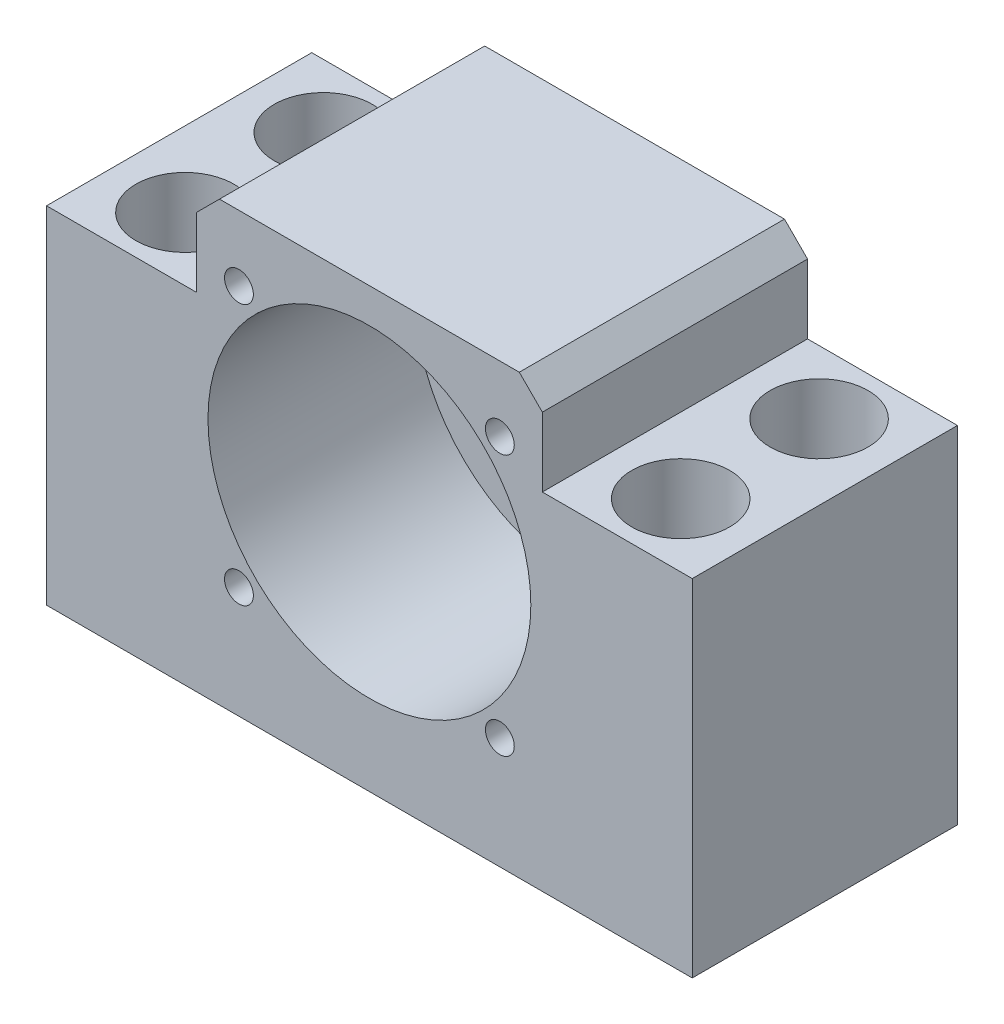
ISO-10303-21;
HEADER;
FILE_DESCRIPTION(('STEP AP214'),'2;1');
FILE_NAME('part.step','',(''),(''),'','','');
FILE_SCHEMA(('AUTOMOTIVE_DESIGN { 1 0 10303 214 1 1 1 1 }'));
ENDSEC;
DATA;
#1=APPLICATION_CONTEXT('core data for automotive mechanical design processes');
#2=APPLICATION_PROTOCOL_DEFINITION('international standard','automotive_design',2000,#1);
#3=PRODUCT_CONTEXT('',#1,'mechanical');
#4=PRODUCT('Part','Part','',(#3));
#5=PRODUCT_RELATED_PRODUCT_CATEGORY('part','',(#4));
#6=PRODUCT_DEFINITION_FORMATION('','',#4);
#7=PRODUCT_DEFINITION_CONTEXT('part definition',#1,'design');
#8=PRODUCT_DEFINITION('design','',#6,#7);
#9=PRODUCT_DEFINITION_SHAPE('','',#8);
#10=(LENGTH_UNIT() NAMED_UNIT(*) SI_UNIT(.MILLI.,.METRE.));
#11=(NAMED_UNIT(*) PLANE_ANGLE_UNIT() SI_UNIT($,.RADIAN.));
#12=(NAMED_UNIT(*) SI_UNIT($,.STERADIAN.) SOLID_ANGLE_UNIT());
#13=UNCERTAINTY_MEASURE_WITH_UNIT(LENGTH_MEASURE(1.E-05),#10,'distance_accuracy_value','');
#14=(GEOMETRIC_REPRESENTATION_CONTEXT(3) GLOBAL_UNCERTAINTY_ASSIGNED_CONTEXT((#13)) GLOBAL_UNIT_ASSIGNED_CONTEXT((#10,
#11,#12)) REPRESENTATION_CONTEXT('',''));
#15=CARTESIAN_POINT('',(0.,0.,0.));
#16=DIRECTION('',(0.,0.,1.));
#17=DIRECTION('',(1.,0.,0.));
#18=AXIS2_PLACEMENT_3D('',#15,#16,#17);
#19=CARTESIAN_POINT('',(-11.31370849898,-11.31370849898,2.00000000000955));
#20=DIRECTION('',(0.,0.,1.));
#21=DIRECTION('',(1.,0.,0.));
#22=AXIS2_PLACEMENT_3D('',#19,#20,#21);
#23=CONICAL_SURFACE('',#22,1.24999999999015,1.02974425866186);
#24=CARTESIAN_POINT('',(-11.3137084989887,-11.31370849898,1.2489242262177));
#25=VERTEX_POINT('',#24);
#26=VERTEX_LOOP('',#25);
#27=FACE_BOUND('',#26,.T.);
#28=CARTESIAN_POINT('',(-11.31370849898,-11.31370849898,2.));
#29=DIRECTION('',(0.,0.,1.));
#30=DIRECTION('',(1.,0.,0.));
#31=AXIS2_PLACEMENT_3D('',#28,#29,#30);
#32=CIRCLE('',#31,1.25);
#33=CARTESIAN_POINT('',(-10.06370849898,-11.31370849898,2.));
#34=VERTEX_POINT('',#33);
#35=EDGE_CURVE('E108',#34,#34,#32,.T.);
#36=ORIENTED_EDGE('',*,*,#35,.T.);
#37=EDGE_LOOP('',(#36));
#38=FACE_BOUND('',#37,.T.);
#39=ADVANCED_FACE('F17',(#27,#38),#23,.F.);
#40=CARTESIAN_POINT('',(11.31370849898,-11.31370849898,2.00000000006639));
#41=DIRECTION('',(0.,0.,1.));
#42=DIRECTION('',(1.,0.,0.));
#43=AXIS2_PLACEMENT_3D('',#40,#41,#42);
#44=CONICAL_SURFACE('',#43,1.25000000006442,1.02974425868194);
#45=CARTESIAN_POINT('',(11.3137084989887,-11.31370849898,1.24892422627454));
#46=VERTEX_POINT('',#45);
#47=VERTEX_LOOP('',#46);
#48=FACE_BOUND('',#47,.T.);
#49=CARTESIAN_POINT('',(11.31370849898,-11.31370849898,2.));
#50=DIRECTION('',(0.,0.,1.));
#51=DIRECTION('',(1.,0.,0.));
#52=AXIS2_PLACEMENT_3D('',#49,#50,#51);
#53=CIRCLE('',#52,1.25);
#54=CARTESIAN_POINT('',(12.56370849898,-11.31370849898,2.));
#55=VERTEX_POINT('',#54);
#56=EDGE_CURVE('E110',#55,#55,#53,.T.);
#57=ORIENTED_EDGE('',*,*,#56,.T.);
#58=EDGE_LOOP('',(#57));
#59=FACE_BOUND('',#58,.T.);
#60=ADVANCED_FACE('F105',(#48,#59),#44,.F.);
#61=CARTESIAN_POINT('',(11.31370849898,11.31370849898,2.00000000006639));
#62=DIRECTION('',(0.,0.,1.));
#63=DIRECTION('',(1.,0.,0.));
#64=AXIS2_PLACEMENT_3D('',#61,#62,#63);
#65=CONICAL_SURFACE('',#64,1.25000000006442,1.02974425868194);
#66=CARTESIAN_POINT('',(11.3137084989887,11.31370849898,1.24892422627454));
#67=VERTEX_POINT('',#66);
#68=VERTEX_LOOP('',#67);
#69=FACE_BOUND('',#68,.T.);
#70=CARTESIAN_POINT('',(11.31370849898,11.31370849898,2.));
#71=DIRECTION('',(0.,0.,1.));
#72=DIRECTION('',(1.,0.,0.));
#73=AXIS2_PLACEMENT_3D('',#70,#71,#72);
#74=CIRCLE('',#73,1.25);
#75=CARTESIAN_POINT('',(12.56370849898,11.31370849898,2.));
#76=VERTEX_POINT('',#75);
#77=EDGE_CURVE('E113',#76,#76,#74,.T.);
#78=ORIENTED_EDGE('',*,*,#77,.T.);
#79=EDGE_LOOP('',(#78));
#80=FACE_BOUND('',#79,.T.);
#81=ADVANCED_FACE('F408',(#69,#80),#65,.F.);
#82=CARTESIAN_POINT('',(-11.31370849898,11.31370849898,2.00000000000955));
#83=DIRECTION('',(0.,0.,1.));
#84=DIRECTION('',(1.,0.,0.));
#85=AXIS2_PLACEMENT_3D('',#82,#83,#84);
#86=CONICAL_SURFACE('',#85,1.24999999999015,1.02974425866186);
#87=CARTESIAN_POINT('',(-11.3137084989887,11.31370849898,1.2489242262177));
#88=VERTEX_POINT('',#87);
#89=VERTEX_LOOP('',#88);
#90=FACE_BOUND('',#89,.T.);
#91=CARTESIAN_POINT('',(-11.31370849898,11.31370849898,2.));
#92=DIRECTION('',(0.,0.,1.));
#93=DIRECTION('',(1.,0.,0.));
#94=AXIS2_PLACEMENT_3D('',#91,#92,#93);
#95=CIRCLE('',#94,1.25);
#96=CARTESIAN_POINT('',(-10.06370849898,11.31370849898,2.));
#97=VERTEX_POINT('',#96);
#98=EDGE_CURVE('E196',#97,#97,#95,.T.);
#99=ORIENTED_EDGE('',*,*,#98,.T.);
#100=EDGE_LOOP('',(#99));
#101=FACE_BOUND('',#100,.T.);
#102=ADVANCED_FACE('F405',(#90,#101),#86,.F.);
#103=CARTESIAN_POINT('',(-21.5,-14.,-6.));
#104=DIRECTION('',(0.,1.,0.));
#105=DIRECTION('',(0.,0.,1.));
#106=AXIS2_PLACEMENT_3D('',#103,#104,#105);
#107=PLANE('',#106);
#108=CARTESIAN_POINT('',(-21.5,-14.,-6.));
#109=DIRECTION('',(0.,1.,0.));
#110=DIRECTION('',(0.,0.,1.));
#111=AXIS2_PLACEMENT_3D('',#108,#109,#110);
#112=CIRCLE('',#111,4.25);
#113=CARTESIAN_POINT('',(-21.5,-14.,-1.75));
#114=VERTEX_POINT('',#113);
#115=EDGE_CURVE('E191',#114,#114,#112,.T.);
#116=ORIENTED_EDGE('',*,*,#115,.T.);
#117=EDGE_LOOP('',(#116));
#118=FACE_BOUND('',#117,.T.);
#119=CARTESIAN_POINT('',(-21.5,-14.,-6.));
#120=DIRECTION('',(0.,1.,0.));
#121=DIRECTION('',(0.,0.,1.));
#122=AXIS2_PLACEMENT_3D('',#119,#120,#121);
#123=CIRCLE('',#122,2.6);
#124=CARTESIAN_POINT('',(-21.5,-14.,-3.4));
#125=VERTEX_POINT('',#124);
#126=EDGE_CURVE('E186',#125,#125,#123,.F.);
#127=ORIENTED_EDGE('',*,*,#126,.T.);
#128=EDGE_LOOP('',(#127));
#129=FACE_BOUND('',#128,.T.);
#130=ADVANCED_FACE('F401',(#118,#129),#107,.T.);
#131=CARTESIAN_POINT('',(-21.5,-14.,6.));
#132=DIRECTION('',(0.,1.,0.));
#133=DIRECTION('',(0.,0.,1.));
#134=AXIS2_PLACEMENT_3D('',#131,#132,#133);
#135=PLANE('',#134);
#136=CARTESIAN_POINT('',(-21.5,-14.,6.));
#137=DIRECTION('',(0.,1.,0.));
#138=DIRECTION('',(0.,0.,1.));
#139=AXIS2_PLACEMENT_3D('',#136,#137,#138);
#140=CIRCLE('',#139,4.25);
#141=CARTESIAN_POINT('',(-21.5,-14.,10.25));
#142=VERTEX_POINT('',#141);
#143=EDGE_CURVE('E189',#142,#142,#140,.T.);
#144=ORIENTED_EDGE('',*,*,#143,.T.);
#145=EDGE_LOOP('',(#144));
#146=FACE_BOUND('',#145,.T.);
#147=CARTESIAN_POINT('',(-21.5,-14.,6.));
#148=DIRECTION('',(0.,1.,0.));
#149=DIRECTION('',(0.,0.,1.));
#150=AXIS2_PLACEMENT_3D('',#147,#148,#149);
#151=CIRCLE('',#150,2.6);
#152=CARTESIAN_POINT('',(-21.5,-14.,8.6));
#153=VERTEX_POINT('',#152);
#154=EDGE_CURVE('E180',#153,#153,#151,.F.);
#155=ORIENTED_EDGE('',*,*,#154,.T.);
#156=EDGE_LOOP('',(#155));
#157=FACE_BOUND('',#156,.T.);
#158=ADVANCED_FACE('F397',(#146,#157),#135,.T.);
#159=CARTESIAN_POINT('',(21.5,-14.,-6.));
#160=DIRECTION('',(0.,1.,0.));
#161=DIRECTION('',(0.,0.,1.));
#162=AXIS2_PLACEMENT_3D('',#159,#160,#161);
#163=PLANE('',#162);
#164=CARTESIAN_POINT('',(21.5,-14.,-6.));
#165=DIRECTION('',(0.,1.,0.));
#166=DIRECTION('',(0.,0.,1.));
#167=AXIS2_PLACEMENT_3D('',#164,#165,#166);
#168=CIRCLE('',#167,4.25);
#169=CARTESIAN_POINT('',(21.5,-14.,-1.75));
#170=VERTEX_POINT('',#169);
#171=EDGE_CURVE('E174',#170,#170,#168,.T.);
#172=ORIENTED_EDGE('',*,*,#171,.T.);
#173=EDGE_LOOP('',(#172));
#174=FACE_BOUND('',#173,.T.);
#175=CARTESIAN_POINT('',(21.5,-14.,-6.));
#176=DIRECTION('',(0.,1.,0.));
#177=DIRECTION('',(0.,0.,1.));
#178=AXIS2_PLACEMENT_3D('',#175,#176,#177);
#179=CIRCLE('',#178,2.6);
#180=CARTESIAN_POINT('',(21.5,-14.,-3.4));
#181=VERTEX_POINT('',#180);
#182=EDGE_CURVE('E183',#181,#181,#179,.F.);
#183=ORIENTED_EDGE('',*,*,#182,.T.);
#184=EDGE_LOOP('',(#183));
#185=FACE_BOUND('',#184,.T.);
#186=ADVANCED_FACE('F390',(#174,#185),#163,.T.);
#187=CARTESIAN_POINT('',(21.5,-14.,6.));
#188=DIRECTION('',(0.,1.,0.));
#189=DIRECTION('',(0.,0.,1.));
#190=AXIS2_PLACEMENT_3D('',#187,#188,#189);
#191=PLANE('',#190);
#192=CARTESIAN_POINT('',(21.5,-14.,6.));
#193=DIRECTION('',(0.,1.,0.));
#194=DIRECTION('',(0.,0.,1.));
#195=AXIS2_PLACEMENT_3D('',#192,#193,#194);
#196=CIRCLE('',#195,4.25);
#197=CARTESIAN_POINT('',(21.5,-14.,10.25));
#198=VERTEX_POINT('',#197);
#199=EDGE_CURVE('E171',#198,#198,#196,.T.);
#200=ORIENTED_EDGE('',*,*,#199,.T.);
#201=EDGE_LOOP('',(#200));
#202=FACE_BOUND('',#201,.T.);
#203=CARTESIAN_POINT('',(21.5,-14.,6.));
#204=DIRECTION('',(0.,1.,0.));
#205=DIRECTION('',(0.,0.,1.));
#206=AXIS2_PLACEMENT_3D('',#203,#204,#205);
#207=CIRCLE('',#206,2.6);
#208=CARTESIAN_POINT('',(21.5,-14.,8.6));
#209=VERTEX_POINT('',#208);
#210=EDGE_CURVE('E177',#209,#209,#207,.F.);
#211=ORIENTED_EDGE('',*,*,#210,.T.);
#212=EDGE_LOOP('',(#211));
#213=FACE_BOUND('',#212,.T.);
#214=ADVANCED_FACE('F381',(#202,#213),#191,.T.);
#215=CARTESIAN_POINT('',(0.,0.,-6.5));
#216=DIRECTION('',(0.,0.,1.));
#217=DIRECTION('',(1.,0.,0.));
#218=AXIS2_PLACEMENT_3D('',#215,#216,#217);
#219=CYLINDRICAL_SURFACE('',#218,14.);
#220=CARTESIAN_POINT('',(0.,0.,-6.5));
#221=DIRECTION('',(0.,0.,1.));
#222=DIRECTION('',(1.,0.,0.));
#223=AXIS2_PLACEMENT_3D('',#220,#221,#222);
#224=CIRCLE('',#223,14.);
#225=CARTESIAN_POINT('',(14.,0.,-6.5));
#226=VERTEX_POINT('',#225);
#227=EDGE_CURVE('E20',#226,#226,#224,.T.);
#228=ORIENTED_EDGE('',*,*,#227,.F.);
#229=EDGE_LOOP('',(#228));
#230=FACE_BOUND('',#229,.T.);
#231=CARTESIAN_POINT('',(0.,0.,11.5));
#232=DIRECTION('',(0.,0.,1.));
#233=DIRECTION('',(1.,0.,0.));
#234=AXIS2_PLACEMENT_3D('',#231,#232,#233);
#235=CIRCLE('',#234,14.);
#236=CARTESIAN_POINT('',(14.,0.,11.5));
#237=VERTEX_POINT('',#236);
#238=EDGE_CURVE('E168',#237,#237,#235,.F.);
#239=ORIENTED_EDGE('',*,*,#238,.F.);
#240=EDGE_LOOP('',(#239));
#241=FACE_BOUND('',#240,.T.);
#242=ADVANCED_FACE('F378',(#230,#241),#219,.F.);
#243=CARTESIAN_POINT('',(-11.31370849898,-11.31370849898,11.5));
#244=DIRECTION('',(0.,0.,1.));
#245=DIRECTION('',(1.,0.,0.));
#246=AXIS2_PLACEMENT_3D('',#243,#244,#245);
#247=CYLINDRICAL_SURFACE('',#246,1.25);
#248=ORIENTED_EDGE('',*,*,#35,.F.);
#249=EDGE_LOOP('',(#248));
#250=FACE_BOUND('',#249,.T.);
#251=CARTESIAN_POINT('',(-11.31370849898,-11.31370849898,11.5));
#252=DIRECTION('',(0.,0.,1.));
#253=DIRECTION('',(1.,0.,0.));
#254=AXIS2_PLACEMENT_3D('',#251,#252,#253);
#255=CIRCLE('',#254,1.25);
#256=CARTESIAN_POINT('',(-10.06370849898,-11.31370849898,11.5));
#257=VERTEX_POINT('',#256);
#258=EDGE_CURVE('E165',#257,#257,#255,.F.);
#259=ORIENTED_EDGE('',*,*,#258,.F.);
#260=EDGE_LOOP('',(#259));
#261=FACE_BOUND('',#260,.T.);
#262=ADVANCED_FACE('F380',(#250,#261),#247,.F.);
#263=CARTESIAN_POINT('',(11.31370849898,-11.31370849898,11.5));
#264=DIRECTION('',(0.,0.,1.));
#265=DIRECTION('',(1.,0.,0.));
#266=AXIS2_PLACEMENT_3D('',#263,#264,#265);
#267=CYLINDRICAL_SURFACE('',#266,1.25);
#268=ORIENTED_EDGE('',*,*,#56,.F.);
#269=EDGE_LOOP('',(#268));
#270=FACE_BOUND('',#269,.T.);
#271=CARTESIAN_POINT('',(11.31370849898,-11.31370849898,11.5));
#272=DIRECTION('',(0.,0.,1.));
#273=DIRECTION('',(1.,0.,0.));
#274=AXIS2_PLACEMENT_3D('',#271,#272,#273);
#275=CIRCLE('',#274,1.25);
#276=CARTESIAN_POINT('',(12.56370849898,-11.31370849898,11.5));
#277=VERTEX_POINT('',#276);
#278=EDGE_CURVE('E162',#277,#277,#275,.F.);
#279=ORIENTED_EDGE('',*,*,#278,.F.);
#280=EDGE_LOOP('',(#279));
#281=FACE_BOUND('',#280,.T.);
#282=ADVANCED_FACE('F388',(#270,#281),#267,.F.);
#283=CARTESIAN_POINT('',(11.31370849898,11.31370849898,11.5));
#284=DIRECTION('',(0.,0.,1.));
#285=DIRECTION('',(1.,0.,0.));
#286=AXIS2_PLACEMENT_3D('',#283,#284,#285);
#287=CYLINDRICAL_SURFACE('',#286,1.25);
#288=ORIENTED_EDGE('',*,*,#77,.F.);
#289=EDGE_LOOP('',(#288));
#290=FACE_BOUND('',#289,.T.);
#291=CARTESIAN_POINT('',(11.31370849898,11.31370849898,11.5));
#292=DIRECTION('',(0.,0.,1.));
#293=DIRECTION('',(1.,0.,0.));
#294=AXIS2_PLACEMENT_3D('',#291,#292,#293);
#295=CIRCLE('',#294,1.25);
#296=CARTESIAN_POINT('',(12.56370849898,11.31370849898,11.5));
#297=VERTEX_POINT('',#296);
#298=EDGE_CURVE('E159',#297,#297,#295,.F.);
#299=ORIENTED_EDGE('',*,*,#298,.F.);
#300=EDGE_LOOP('',(#299));
#301=FACE_BOUND('',#300,.T.);
#302=ADVANCED_FACE('F420',(#290,#301),#287,.F.);
#303=CARTESIAN_POINT('',(-11.31370849898,11.31370849898,11.5));
#304=DIRECTION('',(0.,0.,1.));
#305=DIRECTION('',(1.,0.,0.));
#306=AXIS2_PLACEMENT_3D('',#303,#304,#305);
#307=CYLINDRICAL_SURFACE('',#306,1.25);
#308=ORIENTED_EDGE('',*,*,#98,.F.);
#309=EDGE_LOOP('',(#308));
#310=FACE_BOUND('',#309,.T.);
#311=CARTESIAN_POINT('',(-11.31370849898,11.31370849898,11.5));
#312=DIRECTION('',(0.,0.,1.));
#313=DIRECTION('',(1.,0.,0.));
#314=AXIS2_PLACEMENT_3D('',#311,#312,#313);
#315=CIRCLE('',#314,1.25);
#316=CARTESIAN_POINT('',(-10.06370849898,11.31370849898,11.5));
#317=VERTEX_POINT('',#316);
#318=EDGE_CURVE('E156',#317,#317,#315,.F.);
#319=ORIENTED_EDGE('',*,*,#318,.F.);
#320=EDGE_LOOP('',(#319));
#321=FACE_BOUND('',#320,.T.);
#322=ADVANCED_FACE('F424',(#310,#321),#307,.F.);
#323=CARTESIAN_POINT('',(0.,0.,-6.5));
#324=DIRECTION('',(0.,0.,1.));
#325=DIRECTION('',(1.,0.,0.));
#326=AXIS2_PLACEMENT_3D('',#323,#324,#325);
#327=PLANE('',#326);
#328=ORIENTED_EDGE('',*,*,#227,.T.);
#329=EDGE_LOOP('',(#328));
#330=FACE_BOUND('',#329,.T.);
#331=CARTESIAN_POINT('',(0.,0.,-6.5));
#332=DIRECTION('',(0.,0.,-1.));
#333=DIRECTION('',(-1.,0.,0.));
#334=AXIS2_PLACEMENT_3D('',#331,#332,#333);
#335=CIRCLE('',#334,11.);
#336=CARTESIAN_POINT('',(-11.,0.,-6.5));
#337=VERTEX_POINT('',#336);
#338=EDGE_CURVE('E152',#337,#337,#335,.T.);
#339=ORIENTED_EDGE('',*,*,#338,.T.);
#340=EDGE_LOOP('',(#339));
#341=FACE_BOUND('',#340,.T.);
#342=ADVANCED_FACE('F430',(#330,#341),#327,.T.);
#343=CARTESIAN_POINT('',(-21.5,-14.,-6.));
#344=DIRECTION('',(0.,1.,0.));
#345=DIRECTION('',(0.,0.,1.));
#346=AXIS2_PLACEMENT_3D('',#343,#344,#345);
#347=CYLINDRICAL_SURFACE('',#346,4.25);
#348=ORIENTED_EDGE('',*,*,#115,.F.);
#349=EDGE_LOOP('',(#348));
#350=FACE_BOUND('',#349,.T.);
#351=CARTESIAN_POINT('',(-21.5,9.,-6.));
#352=DIRECTION('',(0.,1.,0.));
#353=DIRECTION('',(0.,0.,1.));
#354=AXIS2_PLACEMENT_3D('',#351,#352,#353);
#355=CIRCLE('',#354,4.25);
#356=CARTESIAN_POINT('',(-21.5,9.,-1.75));
#357=VERTEX_POINT('',#356);
#358=EDGE_CURVE('E148',#357,#357,#355,.T.);
#359=ORIENTED_EDGE('',*,*,#358,.T.);
#360=EDGE_LOOP('',(#359));
#361=FACE_BOUND('',#360,.T.);
#362=ADVANCED_FACE('F434',(#350,#361),#347,.F.);
#363=CARTESIAN_POINT('',(-21.5,-14.,6.));
#364=DIRECTION('',(0.,1.,0.));
#365=DIRECTION('',(0.,0.,1.));
#366=AXIS2_PLACEMENT_3D('',#363,#364,#365);
#367=CYLINDRICAL_SURFACE('',#366,4.25);
#368=ORIENTED_EDGE('',*,*,#143,.F.);
#369=EDGE_LOOP('',(#368));
#370=FACE_BOUND('',#369,.T.);
#371=CARTESIAN_POINT('',(-21.5,9.,6.));
#372=DIRECTION('',(0.,1.,0.));
#373=DIRECTION('',(0.,0.,1.));
#374=AXIS2_PLACEMENT_3D('',#371,#372,#373);
#375=CIRCLE('',#374,4.25);
#376=CARTESIAN_POINT('',(-21.5,9.,10.25));
#377=VERTEX_POINT('',#376);
#378=EDGE_CURVE('E144',#377,#377,#375,.T.);
#379=ORIENTED_EDGE('',*,*,#378,.T.);
#380=EDGE_LOOP('',(#379));
#381=FACE_BOUND('',#380,.T.);
#382=ADVANCED_FACE('F437',(#370,#381),#367,.F.);
#383=CARTESIAN_POINT('',(-21.5,-21.,-6.));
#384=DIRECTION('',(0.,1.,0.));
#385=DIRECTION('',(0.,0.,1.));
#386=AXIS2_PLACEMENT_3D('',#383,#384,#385);
#387=CYLINDRICAL_SURFACE('',#386,2.6);
#388=ORIENTED_EDGE('',*,*,#126,.F.);
#389=EDGE_LOOP('',(#388));
#390=FACE_BOUND('',#389,.T.);
#391=CARTESIAN_POINT('',(-21.5,-21.,-6.));
#392=DIRECTION('',(0.,1.,0.));
#393=DIRECTION('',(0.,0.,1.));
#394=AXIS2_PLACEMENT_3D('',#391,#392,#393);
#395=CIRCLE('',#394,2.6);
#396=CARTESIAN_POINT('',(-21.5,-21.,-3.4));
#397=VERTEX_POINT('',#396);
#398=EDGE_CURVE('E140',#397,#397,#395,.F.);
#399=ORIENTED_EDGE('',*,*,#398,.T.);
#400=EDGE_LOOP('',(#399));
#401=FACE_BOUND('',#400,.T.);
#402=ADVANCED_FACE('F441',(#390,#401),#387,.F.);
#403=CARTESIAN_POINT('',(21.5,-21.,-6.));
#404=DIRECTION('',(0.,1.,0.));
#405=DIRECTION('',(0.,0.,1.));
#406=AXIS2_PLACEMENT_3D('',#403,#404,#405);
#407=CYLINDRICAL_SURFACE('',#406,2.6);
#408=ORIENTED_EDGE('',*,*,#182,.F.);
#409=EDGE_LOOP('',(#408));
#410=FACE_BOUND('',#409,.T.);
#411=CARTESIAN_POINT('',(21.5,-21.,-6.));
#412=DIRECTION('',(0.,1.,0.));
#413=DIRECTION('',(0.,0.,1.));
#414=AXIS2_PLACEMENT_3D('',#411,#412,#413);
#415=CIRCLE('',#414,2.6);
#416=CARTESIAN_POINT('',(21.5,-21.,-3.4));
#417=VERTEX_POINT('',#416);
#418=EDGE_CURVE('E137',#417,#417,#415,.F.);
#419=ORIENTED_EDGE('',*,*,#418,.T.);
#420=EDGE_LOOP('',(#419));
#421=FACE_BOUND('',#420,.T.);
#422=ADVANCED_FACE('F445',(#410,#421),#407,.F.);
#423=CARTESIAN_POINT('',(-21.5,-21.,6.));
#424=DIRECTION('',(0.,1.,0.));
#425=DIRECTION('',(0.,0.,1.));
#426=AXIS2_PLACEMENT_3D('',#423,#424,#425);
#427=CYLINDRICAL_SURFACE('',#426,2.6);
#428=ORIENTED_EDGE('',*,*,#154,.F.);
#429=EDGE_LOOP('',(#428));
#430=FACE_BOUND('',#429,.T.);
#431=CARTESIAN_POINT('',(-21.5,-21.,6.));
#432=DIRECTION('',(0.,1.,0.));
#433=DIRECTION('',(0.,0.,1.));
#434=AXIS2_PLACEMENT_3D('',#431,#432,#433);
#435=CIRCLE('',#434,2.6);
#436=CARTESIAN_POINT('',(-21.5,-21.,8.6));
#437=VERTEX_POINT('',#436);
#438=EDGE_CURVE('E134',#437,#437,#435,.F.);
#439=ORIENTED_EDGE('',*,*,#438,.T.);
#440=EDGE_LOOP('',(#439));
#441=FACE_BOUND('',#440,.T.);
#442=ADVANCED_FACE('F332',(#430,#441),#427,.F.);
#443=CARTESIAN_POINT('',(21.5,-21.,6.));
#444=DIRECTION('',(0.,1.,0.));
#445=DIRECTION('',(0.,0.,1.));
#446=AXIS2_PLACEMENT_3D('',#443,#444,#445);
#447=CYLINDRICAL_SURFACE('',#446,2.6);
#448=ORIENTED_EDGE('',*,*,#210,.F.);
#449=EDGE_LOOP('',(#448));
#450=FACE_BOUND('',#449,.T.);
#451=CARTESIAN_POINT('',(21.5,-21.,6.));
#452=DIRECTION('',(0.,1.,0.));
#453=DIRECTION('',(0.,0.,1.));
#454=AXIS2_PLACEMENT_3D('',#451,#452,#453);
#455=CIRCLE('',#454,2.6);
#456=CARTESIAN_POINT('',(21.5,-21.,8.6));
#457=VERTEX_POINT('',#456);
#458=EDGE_CURVE('E130',#457,#457,#455,.F.);
#459=ORIENTED_EDGE('',*,*,#458,.T.);
#460=EDGE_LOOP('',(#459));
#461=FACE_BOUND('',#460,.T.);
#462=ADVANCED_FACE('F321',(#450,#461),#447,.F.);
#463=CARTESIAN_POINT('',(21.5,-14.,-6.));
#464=DIRECTION('',(0.,1.,0.));
#465=DIRECTION('',(0.,0.,1.));
#466=AXIS2_PLACEMENT_3D('',#463,#464,#465);
#467=CYLINDRICAL_SURFACE('',#466,4.25);
#468=ORIENTED_EDGE('',*,*,#171,.F.);
#469=EDGE_LOOP('',(#468));
#470=FACE_BOUND('',#469,.T.);
#471=CARTESIAN_POINT('',(21.5,9.,-6.));
#472=DIRECTION('',(0.,1.,0.));
#473=DIRECTION('',(0.,0.,1.));
#474=AXIS2_PLACEMENT_3D('',#471,#472,#473);
#475=CIRCLE('',#474,4.25);
#476=CARTESIAN_POINT('',(21.5,9.,-1.75));
#477=VERTEX_POINT('',#476);
#478=EDGE_CURVE('E126',#477,#477,#475,.T.);
#479=ORIENTED_EDGE('',*,*,#478,.T.);
#480=EDGE_LOOP('',(#479));
#481=FACE_BOUND('',#480,.T.);
#482=ADVANCED_FACE('F318',(#470,#481),#467,.F.);
#483=CARTESIAN_POINT('',(21.5,-14.,6.));
#484=DIRECTION('',(0.,1.,0.));
#485=DIRECTION('',(0.,0.,1.));
#486=AXIS2_PLACEMENT_3D('',#483,#484,#485);
#487=CYLINDRICAL_SURFACE('',#486,4.25);
#488=ORIENTED_EDGE('',*,*,#199,.F.);
#489=EDGE_LOOP('',(#488));
#490=FACE_BOUND('',#489,.T.);
#491=CARTESIAN_POINT('',(21.5,9.,6.));
#492=DIRECTION('',(0.,1.,0.));
#493=DIRECTION('',(0.,0.,1.));
#494=AXIS2_PLACEMENT_3D('',#491,#492,#493);
#495=CIRCLE('',#494,4.25);
#496=CARTESIAN_POINT('',(21.5,9.,10.25));
#497=VERTEX_POINT('',#496);
#498=EDGE_CURVE('E122',#497,#497,#495,.T.);
#499=ORIENTED_EDGE('',*,*,#498,.T.);
#500=EDGE_LOOP('',(#499));
#501=FACE_BOUND('',#500,.T.);
#502=ADVANCED_FACE('F320',(#490,#501),#487,.F.);
#503=CARTESIAN_POINT('',(-2.25514051877E-13,30.,11.5));
#504=DIRECTION('',(0.,0.,1.));
#505=DIRECTION('',(1.,0.,0.));
#506=AXIS2_PLACEMENT_3D('',#503,#504,#505);
#507=PLANE('',#506);
#508=DIRECTION('',(0.,1.,0.));
#509=VECTOR('',#508,1.);
#510=CARTESIAN_POINT('',(28.,-21.,11.5));
#511=LINE('',#510,#509);
#512=CARTESIAN_POINT('',(28.,-21.,11.5));
#513=VERTEX_POINT('',#512);
#514=CARTESIAN_POINT('',(28.,9.,11.5));
#515=VERTEX_POINT('',#514);
#516=EDGE_CURVE('E129',#513,#515,#511,.T.);
#517=ORIENTED_EDGE('',*,*,#516,.T.);
#518=DIRECTION('',(1.,0.,0.));
#519=VECTOR('',#518,1.);
#520=CARTESIAN_POINT('',(28.,9.,11.5));
#521=LINE('',#520,#519);
#522=CARTESIAN_POINT('',(15.,9.,11.5));
#523=VERTEX_POINT('',#522);
#524=EDGE_CURVE('E121',#515,#523,#521,.F.);
#525=ORIENTED_EDGE('',*,*,#524,.T.);
#526=DIRECTION('',(0.,1.,0.));
#527=VECTOR('',#526,1.);
#528=CARTESIAN_POINT('',(15.,9.,11.5));
#529=LINE('',#528,#527);
#530=CARTESIAN_POINT('',(15.,15.,11.5));
#531=VERTEX_POINT('',#530);
#532=EDGE_CURVE('E155',#523,#531,#529,.T.);
#533=ORIENTED_EDGE('',*,*,#532,.T.);
#534=DIRECTION('',(0.707106781186548,-0.707106781186548,0.));
#535=VECTOR('',#534,1.);
#536=CARTESIAN_POINT('',(13.,17.,11.5));
#537=LINE('',#536,#535);
#538=CARTESIAN_POINT('',(13.,17.,11.5));
#539=VERTEX_POINT('',#538);
#540=EDGE_CURVE('E209',#531,#539,#537,.F.);
#541=ORIENTED_EDGE('',*,*,#540,.T.);
#542=DIRECTION('',(1.,0.,0.));
#543=VECTOR('',#542,1.);
#544=CARTESIAN_POINT('',(13.,17.,11.5));
#545=LINE('',#544,#543);
#546=CARTESIAN_POINT('',(-13.,17.,11.5));
#547=VERTEX_POINT('',#546);
#548=EDGE_CURVE('E214',#539,#547,#545,.F.);
#549=ORIENTED_EDGE('',*,*,#548,.T.);
#550=DIRECTION('',(0.707106781186548,0.707106781186548,0.));
#551=VECTOR('',#550,1.);
#552=CARTESIAN_POINT('',(-15.,15.,11.5));
#553=LINE('',#552,#551);
#554=CARTESIAN_POINT('',(-15.,15.,11.5));
#555=VERTEX_POINT('',#554);
#556=EDGE_CURVE('E219',#547,#555,#553,.F.);
#557=ORIENTED_EDGE('',*,*,#556,.T.);
#558=DIRECTION('',(0.,1.,0.));
#559=VECTOR('',#558,1.);
#560=CARTESIAN_POINT('',(-15.,15.,11.5));
#561=LINE('',#560,#559);
#562=CARTESIAN_POINT('',(-15.,9.,11.5));
#563=VERTEX_POINT('',#562);
#564=EDGE_CURVE('E151',#555,#563,#561,.F.);
#565=ORIENTED_EDGE('',*,*,#564,.T.);
#566=DIRECTION('',(1.,0.,0.));
#567=VECTOR('',#566,1.);
#568=CARTESIAN_POINT('',(-28.,9.,11.5));
#569=LINE('',#568,#567);
#570=CARTESIAN_POINT('',(-28.,9.,11.5));
#571=VERTEX_POINT('',#570);
#572=EDGE_CURVE('E227',#563,#571,#569,.F.);
#573=ORIENTED_EDGE('',*,*,#572,.T.);
#574=DIRECTION('',(0.,1.,0.));
#575=VECTOR('',#574,1.);
#576=CARTESIAN_POINT('',(-28.,-21.,11.5));
#577=LINE('',#576,#575);
#578=CARTESIAN_POINT('',(-28.,-21.,11.5));
#579=VERTEX_POINT('',#578);
#580=EDGE_CURVE('E143',#571,#579,#577,.F.);
#581=ORIENTED_EDGE('',*,*,#580,.T.);
#582=DIRECTION('',(1.,0.,0.));
#583=VECTOR('',#582,1.);
#584=CARTESIAN_POINT('',(-28.,-21.,11.5));
#585=LINE('',#584,#583);
#586=EDGE_CURVE('E235',#579,#513,#585,.T.);
#587=ORIENTED_EDGE('',*,*,#586,.T.);
#588=EDGE_LOOP('',(#517,#525,#533,#541,#549,#557,#565,#573,#581,#587));
#589=FACE_BOUND('',#588,.T.);
#590=ORIENTED_EDGE('',*,*,#318,.T.);
#591=EDGE_LOOP('',(#590));
#592=FACE_BOUND('',#591,.T.);
#593=ORIENTED_EDGE('',*,*,#298,.T.);
#594=EDGE_LOOP('',(#593));
#595=FACE_BOUND('',#594,.T.);
#596=ORIENTED_EDGE('',*,*,#278,.T.);
#597=EDGE_LOOP('',(#596));
#598=FACE_BOUND('',#597,.T.);
#599=ORIENTED_EDGE('',*,*,#258,.T.);
#600=EDGE_LOOP('',(#599));
#601=FACE_BOUND('',#600,.T.);
#602=ORIENTED_EDGE('',*,*,#238,.T.);
#603=EDGE_LOOP('',(#602));
#604=FACE_BOUND('',#603,.T.);
#605=ADVANCED_FACE('F329',(#589,#592,#595,#598,#601,#604),#507,.T.);
#606=CARTESIAN_POINT('',(0.,0.,11.5));
#607=DIRECTION('',(0.,0.,-1.));
#608=DIRECTION('',(-1.,0.,0.));
#609=AXIS2_PLACEMENT_3D('',#606,#607,#608);
#610=CYLINDRICAL_SURFACE('',#609,11.);
#611=ORIENTED_EDGE('',*,*,#338,.F.);
#612=EDGE_LOOP('',(#611));
#613=FACE_BOUND('',#612,.T.);
#614=CARTESIAN_POINT('',(0.,0.,-11.5));
#615=DIRECTION('',(0.,0.,-1.));
#616=DIRECTION('',(-1.,0.,0.));
#617=AXIS2_PLACEMENT_3D('',#614,#615,#616);
#618=CIRCLE('',#617,11.);
#619=CARTESIAN_POINT('',(-11.,0.,-11.5));
#620=VERTEX_POINT('',#619);
#621=EDGE_CURVE('E117',#620,#620,#618,.T.);
#622=ORIENTED_EDGE('',*,*,#621,.T.);
#623=EDGE_LOOP('',(#622));
#624=FACE_BOUND('',#623,.T.);
#625=ADVANCED_FACE('F359',(#613,#624),#610,.F.);
#626=CARTESIAN_POINT('',(15.,9.,11.5));
#627=DIRECTION('',(-1.,0.,0.));
#628=DIRECTION('',(0.,0.,1.));
#629=AXIS2_PLACEMENT_3D('',#626,#627,#628);
#630=PLANE('',#629);
#631=DIRECTION('',(0.,0.,-1.));
#632=VECTOR('',#631,1.);
#633=CARTESIAN_POINT('',(15.,9.,11.5));
#634=LINE('',#633,#632);
#635=CARTESIAN_POINT('',(15.,9.,-11.5));
#636=VERTEX_POINT('',#635);
#637=EDGE_CURVE('E125',#523,#636,#634,.T.);
#638=ORIENTED_EDGE('',*,*,#637,.T.);
#639=DIRECTION('',(0.,1.,0.));
#640=VECTOR('',#639,1.);
#641=CARTESIAN_POINT('',(15.,30.,-11.5));
#642=LINE('',#641,#640);
#643=CARTESIAN_POINT('',(15.,15.,-11.5));
#644=VERTEX_POINT('',#643);
#645=EDGE_CURVE('E120',#636,#644,#642,.T.);
#646=ORIENTED_EDGE('',*,*,#645,.T.);
#647=DIRECTION('',(0.,0.,1.));
#648=VECTOR('',#647,1.);
#649=CARTESIAN_POINT('',(15.,15.,11.5));
#650=LINE('',#649,#648);
#651=EDGE_CURVE('E206',#644,#531,#650,.T.);
#652=ORIENTED_EDGE('',*,*,#651,.T.);
#653=ORIENTED_EDGE('',*,*,#532,.F.);
#654=EDGE_LOOP('',(#638,#646,#652,#653));
#655=FACE_BOUND('',#654,.T.);
#656=ADVANCED_FACE('F308',(#655),#630,.F.);
#657=CARTESIAN_POINT('',(13.,17.,11.5));
#658=DIRECTION('',(-0.707106781186548,-0.707106781186548,0.));
#659=DIRECTION('',(0.707106781186548,-0.707106781186548,0.));
#660=AXIS2_PLACEMENT_3D('',#657,#658,#659);
#661=PLANE('',#660);
#662=ORIENTED_EDGE('',*,*,#651,.F.);
#663=DIRECTION('',(-0.707106781186547,0.707106781186548,0.));
#664=VECTOR('',#663,1.);
#665=CARTESIAN_POINT('',(15.,15.,-11.5));
#666=LINE('',#665,#664);
#667=CARTESIAN_POINT('',(13.,17.,-11.5));
#668=VERTEX_POINT('',#667);
#669=EDGE_CURVE('E248',#644,#668,#666,.T.);
#670=ORIENTED_EDGE('',*,*,#669,.T.);
#671=DIRECTION('',(0.,0.,-1.));
#672=VECTOR('',#671,1.);
#673=CARTESIAN_POINT('',(13.,17.,11.5));
#674=LINE('',#673,#672);
#675=EDGE_CURVE('E211',#668,#539,#674,.F.);
#676=ORIENTED_EDGE('',*,*,#675,.T.);
#677=ORIENTED_EDGE('',*,*,#540,.F.);
#678=EDGE_LOOP('',(#662,#670,#676,#677));
#679=FACE_BOUND('',#678,.T.);
#680=ADVANCED_FACE('F305',(#679),#661,.F.);
#681=CARTESIAN_POINT('',(13.,17.,11.5));
#682=DIRECTION('',(0.,-1.,0.));
#683=DIRECTION('',(0.,0.,-1.));
#684=AXIS2_PLACEMENT_3D('',#681,#682,#683);
#685=PLANE('',#684);
#686=ORIENTED_EDGE('',*,*,#675,.F.);
#687=DIRECTION('',(1.,0.,0.));
#688=VECTOR('',#687,1.);
#689=CARTESIAN_POINT('',(-2.25514051877E-13,17.,-11.5));
#690=LINE('',#689,#688);
#691=CARTESIAN_POINT('',(-13.,17.,-11.5));
#692=VERTEX_POINT('',#691);
#693=EDGE_CURVE('E251',#668,#692,#690,.F.);
#694=ORIENTED_EDGE('',*,*,#693,.T.);
#695=DIRECTION('',(0.,0.,1.));
#696=VECTOR('',#695,1.);
#697=CARTESIAN_POINT('',(-13.,17.,11.5));
#698=LINE('',#697,#696);
#699=EDGE_CURVE('E216',#692,#547,#698,.T.);
#700=ORIENTED_EDGE('',*,*,#699,.T.);
#701=ORIENTED_EDGE('',*,*,#548,.F.);
#702=EDGE_LOOP('',(#686,#694,#700,#701));
#703=FACE_BOUND('',#702,.T.);
#704=ADVANCED_FACE('F302',(#703),#685,.F.);
#705=CARTESIAN_POINT('',(-15.,15.,11.5));
#706=DIRECTION('',(0.707106781186548,-0.707106781186548,0.));
#707=DIRECTION('',(0.707106781186548,0.707106781186548,0.));
#708=AXIS2_PLACEMENT_3D('',#705,#706,#707);
#709=PLANE('',#708);
#710=ORIENTED_EDGE('',*,*,#699,.F.);
#711=DIRECTION('',(-0.707106781186547,-0.707106781186548,0.));
#712=VECTOR('',#711,1.);
#713=CARTESIAN_POINT('',(-13.,17.,-11.5));
#714=LINE('',#713,#712);
#715=CARTESIAN_POINT('',(-15.,15.,-11.5));
#716=VERTEX_POINT('',#715);
#717=EDGE_CURVE('E254',#692,#716,#714,.T.);
#718=ORIENTED_EDGE('',*,*,#717,.T.);
#719=DIRECTION('',(0.,0.,-1.));
#720=VECTOR('',#719,1.);
#721=CARTESIAN_POINT('',(-15.,15.,11.5));
#722=LINE('',#721,#720);
#723=EDGE_CURVE('E221',#716,#555,#722,.F.);
#724=ORIENTED_EDGE('',*,*,#723,.T.);
#725=ORIENTED_EDGE('',*,*,#556,.F.);
#726=EDGE_LOOP('',(#710,#718,#724,#725));
#727=FACE_BOUND('',#726,.T.);
#728=ADVANCED_FACE('F298',(#727),#709,.F.);
#729=CARTESIAN_POINT('',(-15.,15.,11.5));
#730=DIRECTION('',(1.,0.,0.));
#731=DIRECTION('',(0.,0.,-1.));
#732=AXIS2_PLACEMENT_3D('',#729,#730,#731);
#733=PLANE('',#732);
#734=ORIENTED_EDGE('',*,*,#723,.F.);
#735=DIRECTION('',(0.,1.,0.));
#736=VECTOR('',#735,1.);
#737=CARTESIAN_POINT('',(-15.,30.,-11.5));
#738=LINE('',#737,#736);
#739=CARTESIAN_POINT('',(-15.,9.,-11.5));
#740=VERTEX_POINT('',#739);
#741=EDGE_CURVE('E257',#716,#740,#738,.F.);
#742=ORIENTED_EDGE('',*,*,#741,.T.);
#743=DIRECTION('',(0.,0.,-1.));
#744=VECTOR('',#743,1.);
#745=CARTESIAN_POINT('',(-15.,9.,11.5));
#746=LINE('',#745,#744);
#747=EDGE_CURVE('E147',#740,#563,#746,.F.);
#748=ORIENTED_EDGE('',*,*,#747,.T.);
#749=ORIENTED_EDGE('',*,*,#564,.F.);
#750=EDGE_LOOP('',(#734,#742,#748,#749));
#751=FACE_BOUND('',#750,.T.);
#752=ADVANCED_FACE('F294',(#751),#733,.F.);
#753=CARTESIAN_POINT('',(-28.,9.,11.5));
#754=DIRECTION('',(0.,-1.,0.));
#755=DIRECTION('',(0.,0.,-1.));
#756=AXIS2_PLACEMENT_3D('',#753,#754,#755);
#757=PLANE('',#756);
#758=ORIENTED_EDGE('',*,*,#747,.F.);
#759=DIRECTION('',(1.,0.,0.));
#760=VECTOR('',#759,1.);
#761=CARTESIAN_POINT('',(-2.25514051877E-13,9.,-11.5));
#762=LINE('',#761,#760);
#763=CARTESIAN_POINT('',(-28.,9.,-11.5));
#764=VERTEX_POINT('',#763);
#765=EDGE_CURVE('E260',#740,#764,#762,.F.);
#766=ORIENTED_EDGE('',*,*,#765,.T.);
#767=DIRECTION('',(0.,0.,-1.));
#768=VECTOR('',#767,1.);
#769=CARTESIAN_POINT('',(-28.,9.00000000000001,11.5));
#770=LINE('',#769,#768);
#771=EDGE_CURVE('E229',#764,#571,#770,.F.);
#772=ORIENTED_EDGE('',*,*,#771,.T.);
#773=ORIENTED_EDGE('',*,*,#572,.F.);
#774=EDGE_LOOP('',(#758,#766,#772,#773));
#775=FACE_BOUND('',#774,.T.);
#776=ORIENTED_EDGE('',*,*,#378,.F.);
#777=EDGE_LOOP('',(#776));
#778=FACE_BOUND('',#777,.T.);
#779=ORIENTED_EDGE('',*,*,#358,.F.);
#780=EDGE_LOOP('',(#779));
#781=FACE_BOUND('',#780,.T.);
#782=ADVANCED_FACE('F289',(#775,#778,#781),#757,.F.);
#783=CARTESIAN_POINT('',(-28.,-21.,11.5));
#784=DIRECTION('',(1.,0.,0.));
#785=DIRECTION('',(0.,0.,-1.));
#786=AXIS2_PLACEMENT_3D('',#783,#784,#785);
#787=PLANE('',#786);
#788=ORIENTED_EDGE('',*,*,#771,.F.);
#789=DIRECTION('',(0.,1.,0.));
#790=VECTOR('',#789,1.);
#791=CARTESIAN_POINT('',(-28.,30.,-11.5));
#792=LINE('',#791,#790);
#793=CARTESIAN_POINT('',(-28.,-21.,-11.5));
#794=VERTEX_POINT('',#793);
#795=EDGE_CURVE('E263',#764,#794,#792,.F.);
#796=ORIENTED_EDGE('',*,*,#795,.T.);
#797=DIRECTION('',(0.,0.,1.));
#798=VECTOR('',#797,1.);
#799=CARTESIAN_POINT('',(-28.,-21.,11.5));
#800=LINE('',#799,#798);
#801=EDGE_CURVE('E133',#794,#579,#800,.T.);
#802=ORIENTED_EDGE('',*,*,#801,.T.);
#803=ORIENTED_EDGE('',*,*,#580,.F.);
#804=EDGE_LOOP('',(#788,#796,#802,#803));
#805=FACE_BOUND('',#804,.T.);
#806=ADVANCED_FACE('F285',(#805),#787,.F.);
#807=CARTESIAN_POINT('',(-28.,-21.,11.5));
#808=DIRECTION('',(0.,1.,0.));
#809=DIRECTION('',(0.,0.,1.));
#810=AXIS2_PLACEMENT_3D('',#807,#808,#809);
#811=PLANE('',#810);
#812=ORIENTED_EDGE('',*,*,#801,.F.);
#813=DIRECTION('',(1.,0.,0.));
#814=VECTOR('',#813,1.);
#815=CARTESIAN_POINT('',(-2.25514051877E-13,-21.,-11.5));
#816=LINE('',#815,#814);
#817=CARTESIAN_POINT('',(28.,-21.,-11.5));
#818=VERTEX_POINT('',#817);
#819=EDGE_CURVE('E266',#794,#818,#816,.T.);
#820=ORIENTED_EDGE('',*,*,#819,.T.);
#821=DIRECTION('',(0.,0.,1.));
#822=VECTOR('',#821,1.);
#823=CARTESIAN_POINT('',(28.,-21.,11.5));
#824=LINE('',#823,#822);
#825=EDGE_CURVE('E237',#818,#513,#824,.T.);
#826=ORIENTED_EDGE('',*,*,#825,.T.);
#827=ORIENTED_EDGE('',*,*,#586,.F.);
#828=EDGE_LOOP('',(#812,#820,#826,#827));
#829=FACE_BOUND('',#828,.T.);
#830=ORIENTED_EDGE('',*,*,#458,.F.);
#831=EDGE_LOOP('',(#830));
#832=FACE_BOUND('',#831,.T.);
#833=ORIENTED_EDGE('',*,*,#438,.F.);
#834=EDGE_LOOP('',(#833));
#835=FACE_BOUND('',#834,.T.);
#836=ORIENTED_EDGE('',*,*,#418,.F.);
#837=EDGE_LOOP('',(#836));
#838=FACE_BOUND('',#837,.T.);
#839=ORIENTED_EDGE('',*,*,#398,.F.);
#840=EDGE_LOOP('',(#839));
#841=FACE_BOUND('',#840,.T.);
#842=ADVANCED_FACE('F280',(#829,#832,#835,#838,#841),#811,.F.);
#843=CARTESIAN_POINT('',(28.,-21.,11.5));
#844=DIRECTION('',(-1.,0.,0.));
#845=DIRECTION('',(0.,0.,1.));
#846=AXIS2_PLACEMENT_3D('',#843,#844,#845);
#847=PLANE('',#846);
#848=ORIENTED_EDGE('',*,*,#825,.F.);
#849=DIRECTION('',(0.,1.,0.));
#850=VECTOR('',#849,1.);
#851=CARTESIAN_POINT('',(28.,30.,-11.5));
#852=LINE('',#851,#850);
#853=CARTESIAN_POINT('',(28.,9.,-11.5));
#854=VERTEX_POINT('',#853);
#855=EDGE_CURVE('E26',#818,#854,#852,.T.);
#856=ORIENTED_EDGE('',*,*,#855,.T.);
#857=DIRECTION('',(0.,0.,-1.));
#858=VECTOR('',#857,1.);
#859=CARTESIAN_POINT('',(28.,9.,11.5));
#860=LINE('',#859,#858);
#861=EDGE_CURVE('E34',#854,#515,#860,.F.);
#862=ORIENTED_EDGE('',*,*,#861,.T.);
#863=ORIENTED_EDGE('',*,*,#516,.F.);
#864=EDGE_LOOP('',(#848,#856,#862,#863));
#865=FACE_BOUND('',#864,.T.);
#866=ADVANCED_FACE('F272',(#865),#847,.F.);
#867=CARTESIAN_POINT('',(28.,9.,11.5));
#868=DIRECTION('',(0.,-1.,0.));
#869=DIRECTION('',(0.,0.,-1.));
#870=AXIS2_PLACEMENT_3D('',#867,#868,#869);
#871=PLANE('',#870);
#872=ORIENTED_EDGE('',*,*,#861,.F.);
#873=DIRECTION('',(1.,0.,0.));
#874=VECTOR('',#873,1.);
#875=CARTESIAN_POINT('',(-2.25514051877E-13,9.,-11.5));
#876=LINE('',#875,#874);
#877=EDGE_CURVE('E11',#854,#636,#876,.F.);
#878=ORIENTED_EDGE('',*,*,#877,.T.);
#879=ORIENTED_EDGE('',*,*,#637,.F.);
#880=ORIENTED_EDGE('',*,*,#524,.F.);
#881=EDGE_LOOP('',(#872,#878,#879,#880));
#882=FACE_BOUND('',#881,.T.);
#883=ORIENTED_EDGE('',*,*,#498,.F.);
#884=EDGE_LOOP('',(#883));
#885=FACE_BOUND('',#884,.T.);
#886=ORIENTED_EDGE('',*,*,#478,.F.);
#887=EDGE_LOOP('',(#886));
#888=FACE_BOUND('',#887,.T.);
#889=ADVANCED_FACE('F310',(#882,#885,#888),#871,.F.);
#890=CARTESIAN_POINT('',(-2.25514051877E-13,30.,-11.5));
#891=DIRECTION('',(0.,0.,1.));
#892=DIRECTION('',(1.,0.,0.));
#893=AXIS2_PLACEMENT_3D('',#890,#891,#892);
#894=PLANE('',#893);
#895=ORIENTED_EDGE('',*,*,#855,.F.);
#896=ORIENTED_EDGE('',*,*,#819,.F.);
#897=ORIENTED_EDGE('',*,*,#795,.F.);
#898=ORIENTED_EDGE('',*,*,#765,.F.);
#899=ORIENTED_EDGE('',*,*,#741,.F.);
#900=ORIENTED_EDGE('',*,*,#717,.F.);
#901=ORIENTED_EDGE('',*,*,#693,.F.);
#902=ORIENTED_EDGE('',*,*,#669,.F.);
#903=ORIENTED_EDGE('',*,*,#645,.F.);
#904=ORIENTED_EDGE('',*,*,#877,.F.);
#905=EDGE_LOOP('',(#895,#896,#897,#898,#899,#900,#901,#902,#903,#904));
#906=FACE_BOUND('',#905,.T.);
#907=ORIENTED_EDGE('',*,*,#621,.F.);
#908=EDGE_LOOP('',(#907));
#909=FACE_BOUND('',#908,.T.);
#910=ADVANCED_FACE('F276',(#906,#909),#894,.F.);
#911=CLOSED_SHELL('',(#39,#60,#81,#102,#130,#158,#186,#214,#242,#262,#282,#302,#322,#342,#362,
#382,#402,#422,#442,#462,#482,#502,#605,#625,#656,#680,#704,#728,#752,#782,#806,#842,#866,#889,#910));
#912=MANIFOLD_SOLID_BREP('B1',#911);
#913=ADVANCED_BREP_SHAPE_REPRESENTATION('',(#18,#912),#14);
#914=SHAPE_DEFINITION_REPRESENTATION(#9,#913);
ENDSEC;
END-ISO-10303-21;
